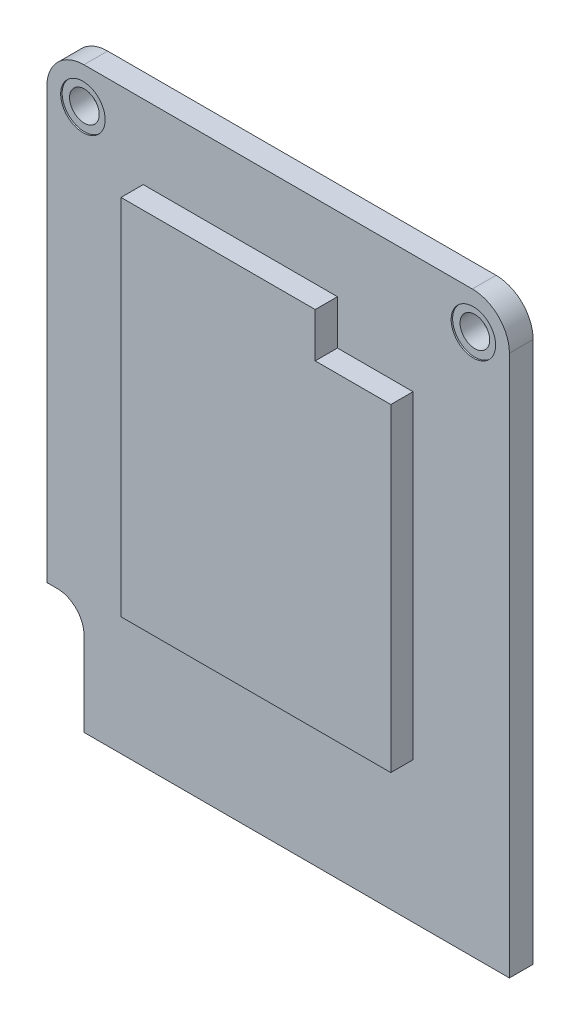
ISO-10303-21;
HEADER;
FILE_DESCRIPTION(('STEP AP214'),'2;1');
FILE_NAME('part.step','',(''),(''),'','','');
FILE_SCHEMA(('AUTOMOTIVE_DESIGN { 1 0 10303 214 1 1 1 1 }'));
ENDSEC;
DATA;
#1=APPLICATION_CONTEXT('core data for automotive mechanical design processes');
#2=APPLICATION_PROTOCOL_DEFINITION('international standard','automotive_design',2000,#1);
#3=PRODUCT_CONTEXT('',#1,'mechanical');
#4=PRODUCT('Part','Part','',(#3));
#5=PRODUCT_RELATED_PRODUCT_CATEGORY('part','',(#4));
#6=PRODUCT_DEFINITION_FORMATION('','',#4);
#7=PRODUCT_DEFINITION_CONTEXT('part definition',#1,'design');
#8=PRODUCT_DEFINITION('design','',#6,#7);
#9=PRODUCT_DEFINITION_SHAPE('','',#8);
#10=(LENGTH_UNIT() NAMED_UNIT(*) SI_UNIT(.MILLI.,.METRE.));
#11=(NAMED_UNIT(*) PLANE_ANGLE_UNIT() SI_UNIT($,.RADIAN.));
#12=(NAMED_UNIT(*) SI_UNIT($,.STERADIAN.) SOLID_ANGLE_UNIT());
#13=UNCERTAINTY_MEASURE_WITH_UNIT(LENGTH_MEASURE(1.E-05),#10,'distance_accuracy_value','');
#14=(GEOMETRIC_REPRESENTATION_CONTEXT(3) GLOBAL_UNCERTAINTY_ASSIGNED_CONTEXT((#13)) GLOBAL_UNIT_ASSIGNED_CONTEXT((#10,
#11,#12)) REPRESENTATION_CONTEXT('',''));
#15=CARTESIAN_POINT('',(0.,0.,0.));
#16=DIRECTION('',(0.,0.,1.));
#17=DIRECTION('',(1.,0.,0.));
#18=AXIS2_PLACEMENT_3D('',#15,#16,#17);
#19=CARTESIAN_POINT('',(-13.17,17.,1.6));
#20=DIRECTION('',(0.,0.,-1.));
#21=DIRECTION('',(-1.,0.,0.));
#22=AXIS2_PLACEMENT_3D('',#19,#20,#21);
#23=CYLINDRICAL_SURFACE('',#22,1.5);
#24=CARTESIAN_POINT('',(-13.17,17.,0.));
#25=DIRECTION('',(0.,0.,1.));
#26=DIRECTION('',(1.,0.,0.));
#27=AXIS2_PLACEMENT_3D('',#24,#25,#26);
#28=CIRCLE('',#27,1.5);
#29=CARTESIAN_POINT('',(-11.67,17.,0.));
#30=VERTEX_POINT('',#29);
#31=EDGE_CURVE('E224',#30,#30,#28,.T.);
#32=ORIENTED_EDGE('',*,*,#31,.F.);
#33=EDGE_LOOP('',(#32));
#34=FACE_BOUND('',#33,.T.);
#35=CARTESIAN_POINT('',(-13.17,17.,0.1));
#36=DIRECTION('',(0.,0.,1.));
#37=DIRECTION('',(1.,0.,0.));
#38=AXIS2_PLACEMENT_3D('',#35,#36,#37);
#39=CIRCLE('',#38,1.5);
#40=CARTESIAN_POINT('',(-11.67,17.,0.1));
#41=VERTEX_POINT('',#40);
#42=EDGE_CURVE('E169',#41,#41,#39,.T.);
#43=ORIENTED_EDGE('',*,*,#42,.T.);
#44=EDGE_LOOP('',(#43));
#45=FACE_BOUND('',#44,.T.);
#46=ADVANCED_FACE('F39',(#34,#45),#23,.F.);
#47=CARTESIAN_POINT('',(13.17,17.,1.6));
#48=DIRECTION('',(0.,0.,-1.));
#49=DIRECTION('',(-1.,0.,0.));
#50=AXIS2_PLACEMENT_3D('',#47,#48,#49);
#51=CYLINDRICAL_SURFACE('',#50,1.5);
#52=CARTESIAN_POINT('',(13.17,17.,0.));
#53=DIRECTION('',(0.,0.,1.));
#54=DIRECTION('',(1.,0.,0.));
#55=AXIS2_PLACEMENT_3D('',#52,#53,#54);
#56=CIRCLE('',#55,1.5);
#57=CARTESIAN_POINT('',(14.67,17.,0.));
#58=VERTEX_POINT('',#57);
#59=EDGE_CURVE('E187',#58,#58,#56,.T.);
#60=ORIENTED_EDGE('',*,*,#59,.F.);
#61=EDGE_LOOP('',(#60));
#62=FACE_BOUND('',#61,.T.);
#63=CARTESIAN_POINT('',(13.17,17.,0.1));
#64=DIRECTION('',(0.,0.,1.));
#65=DIRECTION('',(1.,0.,0.));
#66=AXIS2_PLACEMENT_3D('',#63,#64,#65);
#67=CIRCLE('',#66,1.5);
#68=CARTESIAN_POINT('',(14.67,17.,0.1));
#69=VERTEX_POINT('',#68);
#70=EDGE_CURVE('E181',#69,#69,#67,.T.);
#71=ORIENTED_EDGE('',*,*,#70,.T.);
#72=EDGE_LOOP('',(#71));
#73=FACE_BOUND('',#72,.T.);
#74=ADVANCED_FACE('F281',(#62,#73),#51,.F.);
#75=CARTESIAN_POINT('',(-14.9,-13.8,1.6));
#76=DIRECTION('',(0.,0.,-1.));
#77=DIRECTION('',(-1.,0.,0.));
#78=AXIS2_PLACEMENT_3D('',#75,#76,#77);
#79=CYLINDRICAL_SURFACE('',#78,1.8);
#80=CARTESIAN_POINT('',(-14.9,-13.8,0.));
#81=DIRECTION('',(0.,0.,1.));
#82=DIRECTION('',(1.,0.,0.));
#83=AXIS2_PLACEMENT_3D('',#80,#81,#82);
#84=CIRCLE('',#83,1.8);
#85=CARTESIAN_POINT('',(-13.1,-13.8,0.));
#86=VERTEX_POINT('',#85);
#87=CARTESIAN_POINT('',(-14.9,-12.,0.));
#88=VERTEX_POINT('',#87);
#89=EDGE_CURVE('E227',#86,#88,#84,.T.);
#90=ORIENTED_EDGE('',*,*,#89,.F.);
#91=DIRECTION('',(0.,0.,-1.));
#92=VECTOR('',#91,1.);
#93=CARTESIAN_POINT('',(-13.1,-13.8,1.6));
#94=LINE('',#93,#92);
#95=CARTESIAN_POINT('',(-13.1,-13.8,1.6));
#96=VERTEX_POINT('',#95);
#97=EDGE_CURVE('E271',#96,#86,#94,.T.);
#98=ORIENTED_EDGE('',*,*,#97,.F.);
#99=CARTESIAN_POINT('',(-14.9,-13.8,1.6));
#100=DIRECTION('',(0.,0.,1.));
#101=DIRECTION('',(1.,0.,0.));
#102=AXIS2_PLACEMENT_3D('',#99,#100,#101);
#103=CIRCLE('',#102,1.8);
#104=CARTESIAN_POINT('',(-14.9,-12.,1.6));
#105=VERTEX_POINT('',#104);
#106=EDGE_CURVE('E197',#96,#105,#103,.T.);
#107=ORIENTED_EDGE('',*,*,#106,.T.);
#108=DIRECTION('',(0.,0.,-1.));
#109=VECTOR('',#108,1.);
#110=CARTESIAN_POINT('',(-14.9,-12.,1.6));
#111=LINE('',#110,#109);
#112=EDGE_CURVE('E221',#105,#88,#111,.T.);
#113=ORIENTED_EDGE('',*,*,#112,.T.);
#114=EDGE_LOOP('',(#90,#98,#107,#113));
#115=FACE_BOUND('',#114,.T.);
#116=ADVANCED_FACE('F299',(#115),#79,.F.);
#117=CARTESIAN_POINT('',(-13.1,0.,1.6));
#118=DIRECTION('',(1.,0.,0.));
#119=DIRECTION('',(0.,0.,-1.));
#120=AXIS2_PLACEMENT_3D('',#117,#118,#119);
#121=PLANE('',#120);
#122=DIRECTION('',(0.,-1.,0.));
#123=VECTOR('',#122,1.);
#124=CARTESIAN_POINT('',(-13.1,0.,0.));
#125=LINE('',#124,#123);
#126=CARTESIAN_POINT('',(-13.1,-19.5,0.));
#127=VERTEX_POINT('',#126);
#128=EDGE_CURVE('E230',#86,#127,#125,.T.);
#129=ORIENTED_EDGE('',*,*,#128,.T.);
#130=DIRECTION('',(0.,0.,-1.));
#131=VECTOR('',#130,1.);
#132=CARTESIAN_POINT('',(-13.1,-19.5,1.6));
#133=LINE('',#132,#131);
#134=CARTESIAN_POINT('',(-13.1,-19.5,1.6));
#135=VERTEX_POINT('',#134);
#136=EDGE_CURVE('E268',#135,#127,#133,.T.);
#137=ORIENTED_EDGE('',*,*,#136,.F.);
#138=DIRECTION('',(0.,-1.,0.));
#139=VECTOR('',#138,1.);
#140=CARTESIAN_POINT('',(-13.1,0.,1.6));
#141=LINE('',#140,#139);
#142=EDGE_CURVE('E200',#96,#135,#141,.T.);
#143=ORIENTED_EDGE('',*,*,#142,.F.);
#144=ORIENTED_EDGE('',*,*,#97,.T.);
#145=EDGE_LOOP('',(#129,#137,#143,#144));
#146=FACE_BOUND('',#145,.T.);
#147=ADVANCED_FACE('F302',(#146),#121,.F.);
#148=CARTESIAN_POINT('',(0.,-19.5,1.6));
#149=DIRECTION('',(0.,1.,0.));
#150=DIRECTION('',(0.,0.,1.));
#151=AXIS2_PLACEMENT_3D('',#148,#149,#150);
#152=PLANE('',#151);
#153=DIRECTION('',(1.,0.,0.));
#154=VECTOR('',#153,1.);
#155=CARTESIAN_POINT('',(0.,-19.5,0.));
#156=LINE('',#155,#154);
#157=CARTESIAN_POINT('',(15.6,-19.5,0.));
#158=VERTEX_POINT('',#157);
#159=EDGE_CURVE('E233',#127,#158,#156,.T.);
#160=ORIENTED_EDGE('',*,*,#159,.T.);
#161=DIRECTION('',(0.,0.,-1.));
#162=VECTOR('',#161,1.);
#163=CARTESIAN_POINT('',(15.6,-19.5,1.6));
#164=LINE('',#163,#162);
#165=CARTESIAN_POINT('',(15.6,-19.5,1.6));
#166=VERTEX_POINT('',#165);
#167=EDGE_CURVE('E265',#166,#158,#164,.T.);
#168=ORIENTED_EDGE('',*,*,#167,.F.);
#169=DIRECTION('',(1.,0.,0.));
#170=VECTOR('',#169,1.);
#171=CARTESIAN_POINT('',(0.,-19.5,1.6));
#172=LINE('',#171,#170);
#173=EDGE_CURVE('E203',#135,#166,#172,.T.);
#174=ORIENTED_EDGE('',*,*,#173,.F.);
#175=ORIENTED_EDGE('',*,*,#136,.T.);
#176=EDGE_LOOP('',(#160,#168,#174,#175));
#177=FACE_BOUND('',#176,.T.);
#178=ADVANCED_FACE('F304',(#177),#152,.F.);
#179=CARTESIAN_POINT('',(15.6,0.,1.6));
#180=DIRECTION('',(-1.,0.,0.));
#181=DIRECTION('',(0.,0.,1.));
#182=AXIS2_PLACEMENT_3D('',#179,#180,#181);
#183=PLANE('',#182);
#184=DIRECTION('',(0.,1.,0.));
#185=VECTOR('',#184,1.);
#186=CARTESIAN_POINT('',(15.6,0.,0.));
#187=LINE('',#186,#185);
#188=CARTESIAN_POINT('',(15.6,17.,0.));
#189=VERTEX_POINT('',#188);
#190=EDGE_CURVE('E236',#158,#189,#187,.T.);
#191=ORIENTED_EDGE('',*,*,#190,.T.);
#192=DIRECTION('',(0.,0.,-1.));
#193=VECTOR('',#192,1.);
#194=CARTESIAN_POINT('',(15.6,17.,1.6));
#195=LINE('',#194,#193);
#196=CARTESIAN_POINT('',(15.6,17.,1.6));
#197=VERTEX_POINT('',#196);
#198=EDGE_CURVE('E262',#197,#189,#195,.T.);
#199=ORIENTED_EDGE('',*,*,#198,.F.);
#200=DIRECTION('',(0.,1.,0.));
#201=VECTOR('',#200,1.);
#202=CARTESIAN_POINT('',(15.6,0.,1.6));
#203=LINE('',#202,#201);
#204=EDGE_CURVE('E206',#166,#197,#203,.T.);
#205=ORIENTED_EDGE('',*,*,#204,.F.);
#206=ORIENTED_EDGE('',*,*,#167,.T.);
#207=EDGE_LOOP('',(#191,#199,#205,#206));
#208=FACE_BOUND('',#207,.T.);
#209=ADVANCED_FACE('F310',(#208),#183,.F.);
#210=CARTESIAN_POINT('',(13.1,17.,1.6));
#211=DIRECTION('',(0.,0.,-1.));
#212=DIRECTION('',(-1.,0.,0.));
#213=AXIS2_PLACEMENT_3D('',#210,#211,#212);
#214=CYLINDRICAL_SURFACE('',#213,2.5);
#215=CARTESIAN_POINT('',(13.1,17.,0.));
#216=DIRECTION('',(0.,0.,1.));
#217=DIRECTION('',(1.,0.,0.));
#218=AXIS2_PLACEMENT_3D('',#215,#216,#217);
#219=CIRCLE('',#218,2.5);
#220=CARTESIAN_POINT('',(13.1,19.5,0.));
#221=VERTEX_POINT('',#220);
#222=EDGE_CURVE('E239',#189,#221,#219,.T.);
#223=ORIENTED_EDGE('',*,*,#222,.T.);
#224=DIRECTION('',(0.,0.,-1.));
#225=VECTOR('',#224,1.);
#226=CARTESIAN_POINT('',(13.1,19.5,1.6));
#227=LINE('',#226,#225);
#228=CARTESIAN_POINT('',(13.1,19.5,1.6));
#229=VERTEX_POINT('',#228);
#230=EDGE_CURVE('E260',#229,#221,#227,.T.);
#231=ORIENTED_EDGE('',*,*,#230,.F.);
#232=CARTESIAN_POINT('',(13.1,17.,1.6));
#233=DIRECTION('',(0.,0.,1.));
#234=DIRECTION('',(1.,0.,0.));
#235=AXIS2_PLACEMENT_3D('',#232,#233,#234);
#236=CIRCLE('',#235,2.5);
#237=EDGE_CURVE('E209',#197,#229,#236,.T.);
#238=ORIENTED_EDGE('',*,*,#237,.F.);
#239=ORIENTED_EDGE('',*,*,#198,.T.);
#240=EDGE_LOOP('',(#223,#231,#238,#239));
#241=FACE_BOUND('',#240,.T.);
#242=ADVANCED_FACE('F312',(#241),#214,.T.);
#243=CARTESIAN_POINT('',(0.,19.5,1.6));
#244=DIRECTION('',(0.,1.,0.));
#245=DIRECTION('',(0.,0.,1.));
#246=AXIS2_PLACEMENT_3D('',#243,#244,#245);
#247=PLANE('',#246);
#248=DIRECTION('',(1.,0.,0.));
#249=VECTOR('',#248,1.);
#250=CARTESIAN_POINT('',(0.,19.5,0.));
#251=LINE('',#250,#249);
#252=CARTESIAN_POINT('',(-13.1,19.5,0.));
#253=VERTEX_POINT('',#252);
#254=EDGE_CURVE('E242',#253,#221,#251,.T.);
#255=ORIENTED_EDGE('',*,*,#254,.F.);
#256=DIRECTION('',(0.,0.,-1.));
#257=VECTOR('',#256,1.);
#258=CARTESIAN_POINT('',(-13.1,19.5,1.6));
#259=LINE('',#258,#257);
#260=CARTESIAN_POINT('',(-13.1,19.5,1.6));
#261=VERTEX_POINT('',#260);
#262=EDGE_CURVE('E258',#261,#253,#259,.T.);
#263=ORIENTED_EDGE('',*,*,#262,.F.);
#264=DIRECTION('',(1.,0.,0.));
#265=VECTOR('',#264,1.);
#266=CARTESIAN_POINT('',(0.,19.5,1.6));
#267=LINE('',#266,#265);
#268=EDGE_CURVE('E211',#261,#229,#267,.T.);
#269=ORIENTED_EDGE('',*,*,#268,.T.);
#270=ORIENTED_EDGE('',*,*,#230,.T.);
#271=EDGE_LOOP('',(#255,#263,#269,#270));
#272=FACE_BOUND('',#271,.T.);
#273=ADVANCED_FACE('F315',(#272),#247,.T.);
#274=CARTESIAN_POINT('',(-13.1,17.,1.6));
#275=DIRECTION('',(0.,0.,-1.));
#276=DIRECTION('',(-1.,0.,0.));
#277=AXIS2_PLACEMENT_3D('',#274,#275,#276);
#278=CYLINDRICAL_SURFACE('',#277,2.5);
#279=CARTESIAN_POINT('',(-13.1,17.,0.));
#280=DIRECTION('',(0.,0.,1.));
#281=DIRECTION('',(1.,0.,0.));
#282=AXIS2_PLACEMENT_3D('',#279,#280,#281);
#283=CIRCLE('',#282,2.5);
#284=CARTESIAN_POINT('',(-15.6,17.,0.));
#285=VERTEX_POINT('',#284);
#286=EDGE_CURVE('E245',#253,#285,#283,.T.);
#287=ORIENTED_EDGE('',*,*,#286,.T.);
#288=DIRECTION('',(0.,0.,-1.));
#289=VECTOR('',#288,1.);
#290=CARTESIAN_POINT('',(-15.6,17.,1.6));
#291=LINE('',#290,#289);
#292=CARTESIAN_POINT('',(-15.6,17.,1.6));
#293=VERTEX_POINT('',#292);
#294=EDGE_CURVE('E256',#293,#285,#291,.T.);
#295=ORIENTED_EDGE('',*,*,#294,.F.);
#296=CARTESIAN_POINT('',(-13.1,17.,1.6));
#297=DIRECTION('',(0.,0.,1.));
#298=DIRECTION('',(1.,0.,0.));
#299=AXIS2_PLACEMENT_3D('',#296,#297,#298);
#300=CIRCLE('',#299,2.5);
#301=EDGE_CURVE('E214',#261,#293,#300,.T.);
#302=ORIENTED_EDGE('',*,*,#301,.F.);
#303=ORIENTED_EDGE('',*,*,#262,.T.);
#304=EDGE_LOOP('',(#287,#295,#302,#303));
#305=FACE_BOUND('',#304,.T.);
#306=ADVANCED_FACE('F319',(#305),#278,.T.);
#307=CARTESIAN_POINT('',(-15.6,0.,1.6));
#308=DIRECTION('',(-1.,0.,0.));
#309=DIRECTION('',(0.,0.,1.));
#310=AXIS2_PLACEMENT_3D('',#307,#308,#309);
#311=PLANE('',#310);
#312=DIRECTION('',(0.,1.,0.));
#313=VECTOR('',#312,1.);
#314=CARTESIAN_POINT('',(-15.6,0.,0.));
#315=LINE('',#314,#313);
#316=CARTESIAN_POINT('',(-15.6,-12.,0.));
#317=VERTEX_POINT('',#316);
#318=EDGE_CURVE('E248',#317,#285,#315,.T.);
#319=ORIENTED_EDGE('',*,*,#318,.F.);
#320=DIRECTION('',(0.,0.,-1.));
#321=VECTOR('',#320,1.);
#322=CARTESIAN_POINT('',(-15.6,-12.,1.6));
#323=LINE('',#322,#321);
#324=CARTESIAN_POINT('',(-15.6,-12.,1.6));
#325=VERTEX_POINT('',#324);
#326=EDGE_CURVE('E254',#325,#317,#323,.T.);
#327=ORIENTED_EDGE('',*,*,#326,.F.);
#328=DIRECTION('',(0.,1.,0.));
#329=VECTOR('',#328,1.);
#330=CARTESIAN_POINT('',(-15.6,0.,1.6));
#331=LINE('',#330,#329);
#332=EDGE_CURVE('E216',#325,#293,#331,.T.);
#333=ORIENTED_EDGE('',*,*,#332,.T.);
#334=ORIENTED_EDGE('',*,*,#294,.T.);
#335=EDGE_LOOP('',(#319,#327,#333,#334));
#336=FACE_BOUND('',#335,.T.);
#337=ADVANCED_FACE('F323',(#336),#311,.T.);
#338=CARTESIAN_POINT('',(-13.17,17.,1.5));
#339=DIRECTION('',(0.,0.,1.));
#340=DIRECTION('',(1.,0.,0.));
#341=AXIS2_PLACEMENT_3D('',#338,#339,#340);
#342=CIRCLE('',#341,1.5);
#343=CARTESIAN_POINT('',(-11.67,17.,1.5));
#344=VERTEX_POINT('',#343);
#345=EDGE_CURVE('E12',#344,#344,#342,.T.);
#346=ORIENTED_EDGE('',*,*,#345,.F.);
#347=EDGE_LOOP('',(#346));
#348=FACE_BOUND('',#347,.T.);
#349=CARTESIAN_POINT('',(-13.17,17.,1.6));
#350=DIRECTION('',(0.,0.,1.));
#351=DIRECTION('',(1.,0.,0.));
#352=AXIS2_PLACEMENT_3D('',#349,#350,#351);
#353=CIRCLE('',#352,1.5);
#354=CARTESIAN_POINT('',(-11.67,17.,1.6));
#355=VERTEX_POINT('',#354);
#356=EDGE_CURVE('E193',#355,#355,#353,.T.);
#357=ORIENTED_EDGE('',*,*,#356,.T.);
#358=EDGE_LOOP('',(#357));
#359=FACE_BOUND('',#358,.T.);
#360=ADVANCED_FACE('F280',(#348,#359),#23,.F.);
#361=CARTESIAN_POINT('',(13.17,17.,1.5));
#362=DIRECTION('',(0.,0.,1.));
#363=DIRECTION('',(1.,0.,0.));
#364=AXIS2_PLACEMENT_3D('',#361,#362,#363);
#365=CIRCLE('',#364,1.5);
#366=CARTESIAN_POINT('',(14.67,17.,1.5));
#367=VERTEX_POINT('',#366);
#368=EDGE_CURVE('E47',#367,#367,#365,.T.);
#369=ORIENTED_EDGE('',*,*,#368,.F.);
#370=EDGE_LOOP('',(#369));
#371=FACE_BOUND('',#370,.T.);
#372=CARTESIAN_POINT('',(13.17,17.,1.6));
#373=DIRECTION('',(0.,0.,1.));
#374=DIRECTION('',(1.,0.,0.));
#375=AXIS2_PLACEMENT_3D('',#372,#373,#374);
#376=CIRCLE('',#375,1.5);
#377=CARTESIAN_POINT('',(14.67,17.,1.6));
#378=VERTEX_POINT('',#377);
#379=EDGE_CURVE('E190',#378,#378,#376,.T.);
#380=ORIENTED_EDGE('',*,*,#379,.T.);
#381=EDGE_LOOP('',(#380));
#382=FACE_BOUND('',#381,.T.);
#383=ADVANCED_FACE('F41',(#371,#382),#51,.F.);
#384=CARTESIAN_POINT('',(0.,-12.,1.6));
#385=DIRECTION('',(0.,1.,0.));
#386=DIRECTION('',(0.,0.,1.));
#387=AXIS2_PLACEMENT_3D('',#384,#385,#386);
#388=PLANE('',#387);
#389=DIRECTION('',(1.,0.,0.));
#390=VECTOR('',#389,1.);
#391=CARTESIAN_POINT('',(0.,-12.,0.));
#392=LINE('',#391,#390);
#393=EDGE_CURVE('E194',#317,#88,#392,.T.);
#394=ORIENTED_EDGE('',*,*,#393,.T.);
#395=ORIENTED_EDGE('',*,*,#112,.F.);
#396=DIRECTION('',(1.,0.,0.));
#397=VECTOR('',#396,1.);
#398=CARTESIAN_POINT('',(0.,-12.,1.6));
#399=LINE('',#398,#397);
#400=EDGE_CURVE('E219',#325,#105,#399,.T.);
#401=ORIENTED_EDGE('',*,*,#400,.F.);
#402=ORIENTED_EDGE('',*,*,#326,.T.);
#403=EDGE_LOOP('',(#394,#395,#401,#402));
#404=FACE_BOUND('',#403,.T.);
#405=ADVANCED_FACE('F279',(#404),#388,.F.);
#406=CARTESIAN_POINT('',(0.,0.,1.6));
#407=DIRECTION('',(0.,0.,1.));
#408=DIRECTION('',(1.,0.,0.));
#409=AXIS2_PLACEMENT_3D('',#406,#407,#408);
#410=PLANE('',#409);
#411=DIRECTION('',(0.,-1.,0.));
#412=VECTOR('',#411,1.);
#413=CARTESIAN_POINT('',(-9.1,-10.,1.6));
#414=LINE('',#413,#412);
#415=CARTESIAN_POINT('',(-9.1,14.5,1.6));
#416=VERTEX_POINT('',#415);
#417=CARTESIAN_POINT('',(-9.1,-10.,1.6));
#418=VERTEX_POINT('',#417);
#419=EDGE_CURVE('E54',#416,#418,#414,.T.);
#420=ORIENTED_EDGE('',*,*,#419,.F.);
#421=DIRECTION('',(-1.,0.,0.));
#422=VECTOR('',#421,1.);
#423=CARTESIAN_POINT('',(-9.1,14.5,1.6));
#424=LINE('',#423,#422);
#425=CARTESIAN_POINT('',(4.,14.5,1.6));
#426=VERTEX_POINT('',#425);
#427=EDGE_CURVE('E58',#426,#416,#424,.T.);
#428=ORIENTED_EDGE('',*,*,#427,.F.);
#429=DIRECTION('',(0.,1.,0.));
#430=VECTOR('',#429,1.);
#431=CARTESIAN_POINT('',(4.,14.5,1.6));
#432=LINE('',#431,#430);
#433=CARTESIAN_POINT('',(4.,11.5,1.6));
#434=VERTEX_POINT('',#433);
#435=EDGE_CURVE('E473',#434,#426,#432,.T.);
#436=ORIENTED_EDGE('',*,*,#435,.F.);
#437=DIRECTION('',(-1.,0.,0.));
#438=VECTOR('',#437,1.);
#439=CARTESIAN_POINT('',(4.,11.5,1.6));
#440=LINE('',#439,#438);
#441=CARTESIAN_POINT('',(9.1,11.5,1.6));
#442=VERTEX_POINT('',#441);
#443=EDGE_CURVE('E488',#442,#434,#440,.T.);
#444=ORIENTED_EDGE('',*,*,#443,.F.);
#445=DIRECTION('',(0.,1.,0.));
#446=VECTOR('',#445,1.);
#447=CARTESIAN_POINT('',(9.1,11.5,1.6));
#448=LINE('',#447,#446);
#449=CARTESIAN_POINT('',(9.1,-10.,1.6));
#450=VERTEX_POINT('',#449);
#451=EDGE_CURVE('E491',#450,#442,#448,.T.);
#452=ORIENTED_EDGE('',*,*,#451,.F.);
#453=DIRECTION('',(1.,0.,0.));
#454=VECTOR('',#453,1.);
#455=CARTESIAN_POINT('',(9.1,-10.,1.6));
#456=LINE('',#455,#454);
#457=EDGE_CURVE('E492',#418,#450,#456,.T.);
#458=ORIENTED_EDGE('',*,*,#457,.F.);
#459=EDGE_LOOP('',(#420,#428,#436,#444,#452,#458));
#460=FACE_BOUND('',#459,.T.);
#461=ORIENTED_EDGE('',*,*,#379,.F.);
#462=EDGE_LOOP('',(#461));
#463=FACE_BOUND('',#462,.T.);
#464=ORIENTED_EDGE('',*,*,#356,.F.);
#465=EDGE_LOOP('',(#464));
#466=FACE_BOUND('',#465,.T.);
#467=ORIENTED_EDGE('',*,*,#106,.F.);
#468=ORIENTED_EDGE('',*,*,#142,.T.);
#469=ORIENTED_EDGE('',*,*,#173,.T.);
#470=ORIENTED_EDGE('',*,*,#204,.T.);
#471=ORIENTED_EDGE('',*,*,#237,.T.);
#472=ORIENTED_EDGE('',*,*,#268,.F.);
#473=ORIENTED_EDGE('',*,*,#301,.T.);
#474=ORIENTED_EDGE('',*,*,#332,.F.);
#475=ORIENTED_EDGE('',*,*,#400,.T.);
#476=EDGE_LOOP('',(#467,#468,#469,#470,#471,#472,#473,#474,#475));
#477=FACE_BOUND('',#476,.T.);
#478=ADVANCED_FACE('F284',(#460,#463,#466,#477),#410,.T.);
#479=CARTESIAN_POINT('',(0.,0.,0.));
#480=DIRECTION('',(0.,0.,1.));
#481=DIRECTION('',(1.,0.,0.));
#482=AXIS2_PLACEMENT_3D('',#479,#480,#481);
#483=PLANE('',#482);
#484=ORIENTED_EDGE('',*,*,#59,.T.);
#485=EDGE_LOOP('',(#484));
#486=FACE_BOUND('',#485,.T.);
#487=ORIENTED_EDGE('',*,*,#31,.T.);
#488=EDGE_LOOP('',(#487));
#489=FACE_BOUND('',#488,.T.);
#490=ORIENTED_EDGE('',*,*,#89,.T.);
#491=ORIENTED_EDGE('',*,*,#393,.F.);
#492=ORIENTED_EDGE('',*,*,#318,.T.);
#493=ORIENTED_EDGE('',*,*,#286,.F.);
#494=ORIENTED_EDGE('',*,*,#254,.T.);
#495=ORIENTED_EDGE('',*,*,#222,.F.);
#496=ORIENTED_EDGE('',*,*,#190,.F.);
#497=ORIENTED_EDGE('',*,*,#159,.F.);
#498=ORIENTED_EDGE('',*,*,#128,.F.);
#499=EDGE_LOOP('',(#490,#491,#492,#493,#494,#495,#496,#497,#498));
#500=FACE_BOUND('',#499,.T.);
#501=ADVANCED_FACE('F287',(#486,#489,#500),#483,.F.);
#502=CARTESIAN_POINT('',(13.17,17.,5.84264068711929));
#503=DIRECTION('',(0.,0.,-1.));
#504=DIRECTION('',(-1.,0.,0.));
#505=AXIS2_PLACEMENT_3D('',#502,#503,#504);
#506=CYLINDRICAL_SURFACE('',#505,1.);
#507=CARTESIAN_POINT('',(13.17,17.,0.1));
#508=DIRECTION('',(0.,0.,1.));
#509=DIRECTION('',(1.,0.,0.));
#510=AXIS2_PLACEMENT_3D('',#507,#508,#509);
#511=CIRCLE('',#510,1.);
#512=CARTESIAN_POINT('',(14.17,17.,0.1));
#513=VERTEX_POINT('',#512);
#514=EDGE_CURVE('E184',#513,#513,#511,.T.);
#515=ORIENTED_EDGE('',*,*,#514,.F.);
#516=EDGE_LOOP('',(#515));
#517=FACE_BOUND('',#516,.T.);
#518=CARTESIAN_POINT('',(13.17,17.,1.5));
#519=DIRECTION('',(0.,0.,1.));
#520=DIRECTION('',(1.,0.,0.));
#521=AXIS2_PLACEMENT_3D('',#518,#519,#520);
#522=CIRCLE('',#521,1.);
#523=CARTESIAN_POINT('',(14.17,17.,1.5));
#524=VERTEX_POINT('',#523);
#525=EDGE_CURVE('E179',#524,#524,#522,.T.);
#526=ORIENTED_EDGE('',*,*,#525,.T.);
#527=EDGE_LOOP('',(#526));
#528=FACE_BOUND('',#527,.T.);
#529=ADVANCED_FACE('F328',(#517,#528),#506,.F.);
#530=CARTESIAN_POINT('',(0.,0.,0.1));
#531=DIRECTION('',(0.,0.,1.));
#532=DIRECTION('',(1.,0.,0.));
#533=AXIS2_PLACEMENT_3D('',#530,#531,#532);
#534=PLANE('',#533);
#535=ORIENTED_EDGE('',*,*,#514,.T.);
#536=EDGE_LOOP('',(#535));
#537=FACE_BOUND('',#536,.T.);
#538=ORIENTED_EDGE('',*,*,#70,.F.);
#539=EDGE_LOOP('',(#538));
#540=FACE_BOUND('',#539,.T.);
#541=ADVANCED_FACE('F335',(#537,#540),#534,.F.);
#542=CARTESIAN_POINT('',(0.,0.,1.5));
#543=DIRECTION('',(0.,0.,1.));
#544=DIRECTION('',(1.,0.,0.));
#545=AXIS2_PLACEMENT_3D('',#542,#543,#544);
#546=PLANE('',#545);
#547=ORIENTED_EDGE('',*,*,#525,.F.);
#548=EDGE_LOOP('',(#547));
#549=FACE_BOUND('',#548,.T.);
#550=ORIENTED_EDGE('',*,*,#368,.T.);
#551=EDGE_LOOP('',(#550));
#552=FACE_BOUND('',#551,.T.);
#553=ADVANCED_FACE('F275',(#549,#552),#546,.T.);
#554=CARTESIAN_POINT('',(-13.17,17.,5.84264068711929));
#555=DIRECTION('',(0.,0.,-1.));
#556=DIRECTION('',(-1.,0.,0.));
#557=AXIS2_PLACEMENT_3D('',#554,#555,#556);
#558=CYLINDRICAL_SURFACE('',#557,1.);
#559=CARTESIAN_POINT('',(-13.17,17.,0.1));
#560=DIRECTION('',(0.,0.,1.));
#561=DIRECTION('',(1.,0.,0.));
#562=AXIS2_PLACEMENT_3D('',#559,#560,#561);
#563=CIRCLE('',#562,1.);
#564=CARTESIAN_POINT('',(-12.17,17.,0.1));
#565=VERTEX_POINT('',#564);
#566=EDGE_CURVE('E177',#565,#565,#563,.T.);
#567=ORIENTED_EDGE('',*,*,#566,.F.);
#568=EDGE_LOOP('',(#567));
#569=FACE_BOUND('',#568,.T.);
#570=CARTESIAN_POINT('',(-13.17,17.,1.5));
#571=DIRECTION('',(0.,0.,1.));
#572=DIRECTION('',(1.,0.,0.));
#573=AXIS2_PLACEMENT_3D('',#570,#571,#572);
#574=CIRCLE('',#573,1.);
#575=CARTESIAN_POINT('',(-12.17,17.,1.5));
#576=VERTEX_POINT('',#575);
#577=EDGE_CURVE('E166',#576,#576,#574,.T.);
#578=ORIENTED_EDGE('',*,*,#577,.T.);
#579=EDGE_LOOP('',(#578));
#580=FACE_BOUND('',#579,.T.);
#581=ADVANCED_FACE('F368',(#569,#580),#558,.F.);
#582=CARTESIAN_POINT('',(0.,0.,0.1));
#583=DIRECTION('',(0.,0.,1.));
#584=DIRECTION('',(1.,0.,0.));
#585=AXIS2_PLACEMENT_3D('',#582,#583,#584);
#586=PLANE('',#585);
#587=ORIENTED_EDGE('',*,*,#566,.T.);
#588=EDGE_LOOP('',(#587));
#589=FACE_BOUND('',#588,.T.);
#590=ORIENTED_EDGE('',*,*,#42,.F.);
#591=EDGE_LOOP('',(#590));
#592=FACE_BOUND('',#591,.T.);
#593=ADVANCED_FACE('F360',(#589,#592),#586,.F.);
#594=CARTESIAN_POINT('',(0.,0.,1.5));
#595=DIRECTION('',(0.,0.,1.));
#596=DIRECTION('',(1.,0.,0.));
#597=AXIS2_PLACEMENT_3D('',#594,#595,#596);
#598=PLANE('',#597);
#599=ORIENTED_EDGE('',*,*,#577,.F.);
#600=EDGE_LOOP('',(#599));
#601=FACE_BOUND('',#600,.T.);
#602=ORIENTED_EDGE('',*,*,#345,.T.);
#603=EDGE_LOOP('',(#602));
#604=FACE_BOUND('',#603,.T.);
#605=ADVANCED_FACE('F358',(#601,#604),#598,.T.);
#606=CARTESIAN_POINT('',(-9.1,-10.,3.1));
#607=DIRECTION('',(1.,0.,0.));
#608=DIRECTION('',(0.,1.,0.));
#609=AXIS2_PLACEMENT_3D('',#606,#607,#608);
#610=PLANE('',#609);
#611=ORIENTED_EDGE('',*,*,#419,.T.);
#612=DIRECTION('',(0.,0.,-1.));
#613=VECTOR('',#612,1.);
#614=CARTESIAN_POINT('',(-9.1,-10.,3.1));
#615=LINE('',#614,#613);
#616=CARTESIAN_POINT('',(-9.1,-10.,3.1));
#617=VERTEX_POINT('',#616);
#618=EDGE_CURVE('E149',#617,#418,#615,.T.);
#619=ORIENTED_EDGE('',*,*,#618,.F.);
#620=DIRECTION('',(0.,-1.,0.));
#621=VECTOR('',#620,1.);
#622=CARTESIAN_POINT('',(-9.1,-10.,3.1));
#623=LINE('',#622,#621);
#624=CARTESIAN_POINT('',(-9.1,14.5,3.1));
#625=VERTEX_POINT('',#624);
#626=EDGE_CURVE('E155',#625,#617,#623,.T.);
#627=ORIENTED_EDGE('',*,*,#626,.F.);
#628=DIRECTION('',(0.,0.,-1.));
#629=VECTOR('',#628,1.);
#630=CARTESIAN_POINT('',(-9.1,14.5,3.1));
#631=LINE('',#630,#629);
#632=EDGE_CURVE('E470',#625,#416,#631,.T.);
#633=ORIENTED_EDGE('',*,*,#632,.T.);
#634=EDGE_LOOP('',(#611,#619,#627,#633));
#635=FACE_BOUND('',#634,.T.);
#636=ADVANCED_FACE('F165',(#635),#610,.F.);
#637=CARTESIAN_POINT('',(9.1,-10.,3.1));
#638=DIRECTION('',(0.,1.,0.));
#639=DIRECTION('',(-1.,0.,0.));
#640=AXIS2_PLACEMENT_3D('',#637,#638,#639);
#641=PLANE('',#640);
#642=ORIENTED_EDGE('',*,*,#457,.T.);
#643=DIRECTION('',(0.,0.,-1.));
#644=VECTOR('',#643,1.);
#645=CARTESIAN_POINT('',(9.1,-10.,3.1));
#646=LINE('',#645,#644);
#647=CARTESIAN_POINT('',(9.1,-10.,3.1));
#648=VERTEX_POINT('',#647);
#649=EDGE_CURVE('E151',#648,#450,#646,.T.);
#650=ORIENTED_EDGE('',*,*,#649,.F.);
#651=DIRECTION('',(1.,0.,0.));
#652=VECTOR('',#651,1.);
#653=CARTESIAN_POINT('',(9.1,-10.,3.1));
#654=LINE('',#653,#652);
#655=EDGE_CURVE('E144',#617,#648,#654,.T.);
#656=ORIENTED_EDGE('',*,*,#655,.F.);
#657=ORIENTED_EDGE('',*,*,#618,.T.);
#658=EDGE_LOOP('',(#642,#650,#656,#657));
#659=FACE_BOUND('',#658,.T.);
#660=ADVANCED_FACE('F147',(#659),#641,.F.);
#661=CARTESIAN_POINT('',(9.1,11.5,3.1));
#662=DIRECTION('',(-1.,0.,0.));
#663=DIRECTION('',(0.,-1.,0.));
#664=AXIS2_PLACEMENT_3D('',#661,#662,#663);
#665=PLANE('',#664);
#666=ORIENTED_EDGE('',*,*,#451,.T.);
#667=DIRECTION('',(0.,0.,-1.));
#668=VECTOR('',#667,1.);
#669=CARTESIAN_POINT('',(9.1,11.5,3.1));
#670=LINE('',#669,#668);
#671=CARTESIAN_POINT('',(9.1,11.5,3.1));
#672=VERTEX_POINT('',#671);
#673=EDGE_CURVE('E171',#672,#442,#670,.T.);
#674=ORIENTED_EDGE('',*,*,#673,.F.);
#675=DIRECTION('',(0.,1.,0.));
#676=VECTOR('',#675,1.);
#677=CARTESIAN_POINT('',(9.1,11.5,3.1));
#678=LINE('',#677,#676);
#679=EDGE_CURVE('E154',#648,#672,#678,.T.);
#680=ORIENTED_EDGE('',*,*,#679,.F.);
#681=ORIENTED_EDGE('',*,*,#649,.T.);
#682=EDGE_LOOP('',(#666,#674,#680,#681));
#683=FACE_BOUND('',#682,.T.);
#684=ADVANCED_FACE('F418',(#683),#665,.F.);
#685=CARTESIAN_POINT('',(4.,11.5,3.1));
#686=DIRECTION('',(0.,-1.,0.));
#687=DIRECTION('',(0.,0.,-1.));
#688=AXIS2_PLACEMENT_3D('',#685,#686,#687);
#689=PLANE('',#688);
#690=ORIENTED_EDGE('',*,*,#443,.T.);
#691=DIRECTION('',(0.,0.,-1.));
#692=VECTOR('',#691,1.);
#693=CARTESIAN_POINT('',(4.,11.5,3.1));
#694=LINE('',#693,#692);
#695=CARTESIAN_POINT('',(4.,11.5,3.1));
#696=VERTEX_POINT('',#695);
#697=EDGE_CURVE('E476',#696,#434,#694,.T.);
#698=ORIENTED_EDGE('',*,*,#697,.F.);
#699=DIRECTION('',(-1.,0.,0.));
#700=VECTOR('',#699,1.);
#701=CARTESIAN_POINT('',(4.,11.5,3.1));
#702=LINE('',#701,#700);
#703=EDGE_CURVE('E489',#672,#696,#702,.T.);
#704=ORIENTED_EDGE('',*,*,#703,.F.);
#705=ORIENTED_EDGE('',*,*,#673,.T.);
#706=EDGE_LOOP('',(#690,#698,#704,#705));
#707=FACE_BOUND('',#706,.T.);
#708=ADVANCED_FACE('F427',(#707),#689,.F.);
#709=CARTESIAN_POINT('',(4.,14.5,3.1));
#710=DIRECTION('',(-1.,0.,0.));
#711=DIRECTION('',(0.,0.,1.));
#712=AXIS2_PLACEMENT_3D('',#709,#710,#711);
#713=PLANE('',#712);
#714=ORIENTED_EDGE('',*,*,#435,.T.);
#715=DIRECTION('',(0.,0.,-1.));
#716=VECTOR('',#715,1.);
#717=CARTESIAN_POINT('',(4.,14.5,3.1));
#718=LINE('',#717,#716);
#719=CARTESIAN_POINT('',(4.,14.5,3.1));
#720=VERTEX_POINT('',#719);
#721=EDGE_CURVE('E472',#720,#426,#718,.T.);
#722=ORIENTED_EDGE('',*,*,#721,.F.);
#723=DIRECTION('',(0.,1.,0.));
#724=VECTOR('',#723,1.);
#725=CARTESIAN_POINT('',(4.,14.5,3.1));
#726=LINE('',#725,#724);
#727=EDGE_CURVE('E478',#696,#720,#726,.T.);
#728=ORIENTED_EDGE('',*,*,#727,.F.);
#729=ORIENTED_EDGE('',*,*,#697,.T.);
#730=EDGE_LOOP('',(#714,#722,#728,#729));
#731=FACE_BOUND('',#730,.T.);
#732=ADVANCED_FACE('F437',(#731),#713,.F.);
#733=CARTESIAN_POINT('',(-9.1,14.5,3.1));
#734=DIRECTION('',(0.,-1.,0.));
#735=DIRECTION('',(0.,0.,-1.));
#736=AXIS2_PLACEMENT_3D('',#733,#734,#735);
#737=PLANE('',#736);
#738=ORIENTED_EDGE('',*,*,#427,.T.);
#739=ORIENTED_EDGE('',*,*,#632,.F.);
#740=DIRECTION('',(-1.,0.,0.));
#741=VECTOR('',#740,1.);
#742=CARTESIAN_POINT('',(-9.1,14.5,3.1));
#743=LINE('',#742,#741);
#744=EDGE_CURVE('E160',#720,#625,#743,.T.);
#745=ORIENTED_EDGE('',*,*,#744,.F.);
#746=ORIENTED_EDGE('',*,*,#721,.T.);
#747=EDGE_LOOP('',(#738,#739,#745,#746));
#748=FACE_BOUND('',#747,.T.);
#749=ADVANCED_FACE('F447',(#748),#737,.F.);
#750=CARTESIAN_POINT('',(0.,0.,3.1));
#751=DIRECTION('',(0.,0.,-1.));
#752=DIRECTION('',(-1.,0.,0.));
#753=AXIS2_PLACEMENT_3D('',#750,#751,#752);
#754=PLANE('',#753);
#755=ORIENTED_EDGE('',*,*,#626,.T.);
#756=ORIENTED_EDGE('',*,*,#655,.T.);
#757=ORIENTED_EDGE('',*,*,#679,.T.);
#758=ORIENTED_EDGE('',*,*,#703,.T.);
#759=ORIENTED_EDGE('',*,*,#727,.T.);
#760=ORIENTED_EDGE('',*,*,#744,.T.);
#761=EDGE_LOOP('',(#755,#756,#757,#758,#759,#760));
#762=FACE_BOUND('',#761,.T.);
#763=ADVANCED_FACE('F158',(#762),#754,.F.);
#764=CLOSED_SHELL('',(#46,#74,#116,#147,#178,#209,#242,#273,#306,#337,#360,#383,#405,#478,#501,
#529,#541,#553,#581,#593,#605,#636,#660,#684,#708,#732,#749,#763));
#765=MANIFOLD_SOLID_BREP('B2',#764);
#766=ADVANCED_BREP_SHAPE_REPRESENTATION('',(#18,#765),#14);
#767=SHAPE_DEFINITION_REPRESENTATION(#9,#766);
ENDSEC;
END-ISO-10303-21;
